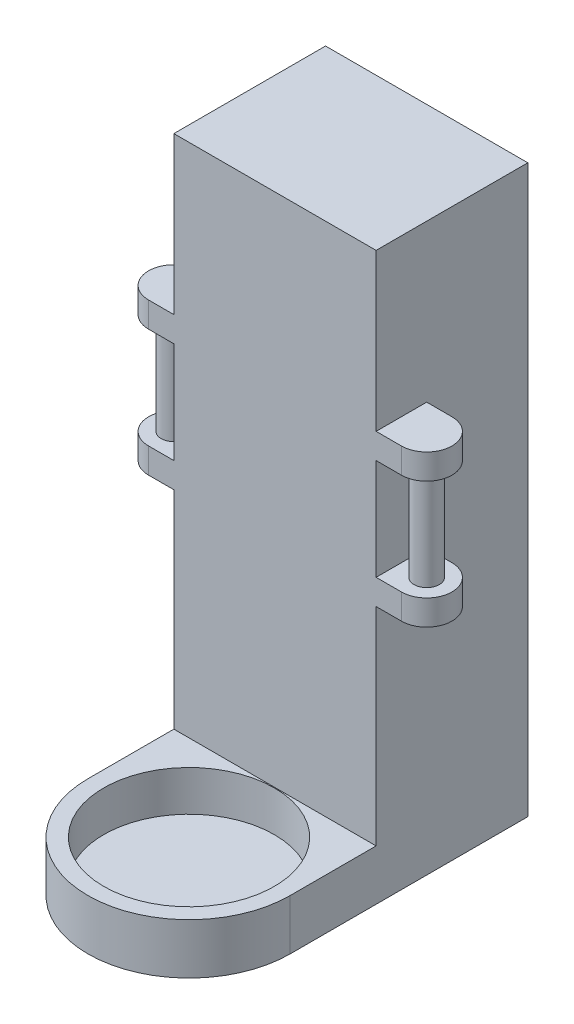
ISO-10303-21;
HEADER;
FILE_DESCRIPTION(('STEP AP214'),'2;1');
FILE_NAME('part.step','',(''),(''),'','','');
FILE_SCHEMA(('AUTOMOTIVE_DESIGN { 1 0 10303 214 1 1 1 1 }'));
ENDSEC;
DATA;
#1=APPLICATION_CONTEXT('core data for automotive mechanical design processes');
#2=APPLICATION_PROTOCOL_DEFINITION('international standard','automotive_design',2000,#1);
#3=PRODUCT_CONTEXT('',#1,'mechanical');
#4=PRODUCT('Part','Part','',(#3));
#5=PRODUCT_RELATED_PRODUCT_CATEGORY('part','',(#4));
#6=PRODUCT_DEFINITION_FORMATION('','',#4);
#7=PRODUCT_DEFINITION_CONTEXT('part definition',#1,'design');
#8=PRODUCT_DEFINITION('design','',#6,#7);
#9=PRODUCT_DEFINITION_SHAPE('','',#8);
#10=(LENGTH_UNIT() NAMED_UNIT(*) SI_UNIT(.MILLI.,.METRE.));
#11=(NAMED_UNIT(*) PLANE_ANGLE_UNIT() SI_UNIT($,.RADIAN.));
#12=(NAMED_UNIT(*) SI_UNIT($,.STERADIAN.) SOLID_ANGLE_UNIT());
#13=UNCERTAINTY_MEASURE_WITH_UNIT(LENGTH_MEASURE(1.E-05),#10,'distance_accuracy_value','');
#14=(GEOMETRIC_REPRESENTATION_CONTEXT(3) GLOBAL_UNCERTAINTY_ASSIGNED_CONTEXT((#13)) GLOBAL_UNIT_ASSIGNED_CONTEXT((#10,
#11,#12)) REPRESENTATION_CONTEXT('',''));
#15=CARTESIAN_POINT('',(0.,0.,0.));
#16=DIRECTION('',(0.,0.,1.));
#17=DIRECTION('',(1.,0.,0.));
#18=AXIS2_PLACEMENT_3D('',#15,#16,#17);
#19=CARTESIAN_POINT('',(-25.4,-71.12,38.1));
#20=DIRECTION('',(1.,0.,0.));
#21=DIRECTION('',(0.,0.,-1.));
#22=AXIS2_PLACEMENT_3D('',#19,#20,#21);
#23=PLANE('',#22);
#24=DIRECTION('',(0.,0.,-1.));
#25=VECTOR('',#24,1.);
#26=CARTESIAN_POINT('',(-25.4,31.75,25.4));
#27=LINE('',#26,#25);
#28=CARTESIAN_POINT('',(-25.4,31.75,38.1));
#29=VERTEX_POINT('',#28);
#30=CARTESIAN_POINT('',(-25.4,31.75,25.4));
#31=VERTEX_POINT('',#30);
#32=EDGE_CURVE('E281',#29,#31,#27,.T.);
#33=ORIENTED_EDGE('',*,*,#32,.F.);
#34=DIRECTION('',(0.,-1.,0.));
#35=VECTOR('',#34,1.);
#36=CARTESIAN_POINT('',(-25.4,-71.12,38.1));
#37=LINE('',#36,#35);
#38=CARTESIAN_POINT('',(-25.4,71.12,38.1));
#39=VERTEX_POINT('',#38);
#40=EDGE_CURVE('E349',#39,#29,#37,.T.);
#41=ORIENTED_EDGE('',*,*,#40,.F.);
#42=DIRECTION('',(0.,0.,-1.));
#43=VECTOR('',#42,1.);
#44=CARTESIAN_POINT('',(-25.4,71.12,38.1));
#45=LINE('',#44,#43);
#46=CARTESIAN_POINT('',(-25.4,71.12,0.));
#47=VERTEX_POINT('',#46);
#48=EDGE_CURVE('E367',#39,#47,#45,.T.);
#49=ORIENTED_EDGE('',*,*,#48,.T.);
#50=DIRECTION('',(0.,-1.,0.));
#51=VECTOR('',#50,1.);
#52=CARTESIAN_POINT('',(-25.4,-71.12,0.));
#53=LINE('',#52,#51);
#54=CARTESIAN_POINT('',(-25.4,-71.12,0.));
#55=VERTEX_POINT('',#54);
#56=EDGE_CURVE('E358',#47,#55,#53,.T.);
#57=ORIENTED_EDGE('',*,*,#56,.T.);
#58=DIRECTION('',(0.,0.,-1.));
#59=VECTOR('',#58,1.);
#60=CARTESIAN_POINT('',(-25.4,-71.12,38.1));
#61=LINE('',#60,#59);
#62=CARTESIAN_POINT('',(-25.4,-71.12,59.69));
#63=VERTEX_POINT('',#62);
#64=EDGE_CURVE('E365',#63,#55,#61,.T.);
#65=ORIENTED_EDGE('',*,*,#64,.F.);
#66=DIRECTION('',(0.,-1.,0.));
#67=VECTOR('',#66,1.);
#68=CARTESIAN_POINT('',(-25.4,-58.42,59.69));
#69=LINE('',#68,#67);
#70=CARTESIAN_POINT('',(-25.4,-58.42,59.69));
#71=VERTEX_POINT('',#70);
#72=EDGE_CURVE('E337',#71,#63,#69,.T.);
#73=ORIENTED_EDGE('',*,*,#72,.F.);
#74=DIRECTION('',(0.,0.,1.));
#75=VECTOR('',#74,1.);
#76=CARTESIAN_POINT('',(-25.4,-58.42,0.));
#77=LINE('',#76,#75);
#78=CARTESIAN_POINT('',(-25.4,-58.42,38.1));
#79=VERTEX_POINT('',#78);
#80=EDGE_CURVE('E329',#79,#71,#77,.T.);
#81=ORIENTED_EDGE('',*,*,#80,.F.);
#82=CARTESIAN_POINT('',(-25.4,-6.34999999999999,38.1));
#83=VERTEX_POINT('',#82);
#84=EDGE_CURVE('E348',#83,#79,#37,.T.);
#85=ORIENTED_EDGE('',*,*,#84,.F.);
#86=DIRECTION('',(0.,0.,1.));
#87=VECTOR('',#86,1.);
#88=CARTESIAN_POINT('',(-25.4,-6.34999999999999,38.1));
#89=LINE('',#88,#87);
#90=CARTESIAN_POINT('',(-25.4,-6.35,25.4));
#91=VERTEX_POINT('',#90);
#92=EDGE_CURVE('E283',#91,#83,#89,.T.);
#93=ORIENTED_EDGE('',*,*,#92,.F.);
#94=DIRECTION('',(0.,-1.,0.));
#95=VECTOR('',#94,1.);
#96=CARTESIAN_POINT('',(-25.4,-6.35,25.4));
#97=LINE('',#96,#95);
#98=CARTESIAN_POINT('',(-25.4,0.,25.4));
#99=VERTEX_POINT('',#98);
#100=EDGE_CURVE('E292',#99,#91,#97,.T.);
#101=ORIENTED_EDGE('',*,*,#100,.F.);
#102=DIRECTION('',(0.,0.,-1.));
#103=VECTOR('',#102,1.);
#104=CARTESIAN_POINT('',(-25.4,0.,25.4));
#105=LINE('',#104,#103);
#106=CARTESIAN_POINT('',(-25.4,0.,38.1));
#107=VERTEX_POINT('',#106);
#108=EDGE_CURVE('E298',#107,#99,#105,.T.);
#109=ORIENTED_EDGE('',*,*,#108,.F.);
#110=CARTESIAN_POINT('',(-25.4,25.4,38.1));
#111=VERTEX_POINT('',#110);
#112=EDGE_CURVE('E353',#111,#107,#37,.T.);
#113=ORIENTED_EDGE('',*,*,#112,.F.);
#114=DIRECTION('',(0.,0.,1.));
#115=VECTOR('',#114,1.);
#116=CARTESIAN_POINT('',(-25.4,25.4,38.1));
#117=LINE('',#116,#115);
#118=CARTESIAN_POINT('',(-25.4,25.4,25.4));
#119=VERTEX_POINT('',#118);
#120=EDGE_CURVE('E275',#119,#111,#117,.T.);
#121=ORIENTED_EDGE('',*,*,#120,.F.);
#122=DIRECTION('',(0.,-1.,0.));
#123=VECTOR('',#122,1.);
#124=CARTESIAN_POINT('',(-25.4,25.4,25.4));
#125=LINE('',#124,#123);
#126=EDGE_CURVE('E278',#31,#119,#125,.T.);
#127=ORIENTED_EDGE('',*,*,#126,.F.);
#128=EDGE_LOOP('',(#33,#41,#49,#57,#65,#73,#81,#85,#93,#101,#109,#113,#121,#127));
#129=FACE_BOUND('',#128,.T.);
#130=ADVANCED_FACE('F45',(#129),#23,.F.);
#131=CARTESIAN_POINT('',(0.,-58.42,59.69));
#132=DIRECTION('',(0.,-1.,0.));
#133=DIRECTION('',(0.,0.,-1.));
#134=AXIS2_PLACEMENT_3D('',#131,#132,#133);
#135=CYLINDRICAL_SURFACE('',#134,21.43125);
#136=CARTESIAN_POINT('',(0.,-58.42,59.69));
#137=DIRECTION('',(0.,-1.,0.));
#138=DIRECTION('',(0.,0.,-1.));
#139=AXIS2_PLACEMENT_3D('',#136,#137,#138);
#140=CIRCLE('',#139,21.43125);
#141=CARTESIAN_POINT('',(0.,-58.42,38.25875));
#142=VERTEX_POINT('',#141);
#143=EDGE_CURVE('E320',#142,#142,#140,.T.);
#144=ORIENTED_EDGE('',*,*,#143,.F.);
#145=EDGE_LOOP('',(#144));
#146=FACE_BOUND('',#145,.T.);
#147=CARTESIAN_POINT('',(0.,-68.58,59.69));
#148=DIRECTION('',(0.,-1.,0.));
#149=DIRECTION('',(0.,0.,-1.));
#150=AXIS2_PLACEMENT_3D('',#147,#148,#149);
#151=CIRCLE('',#150,21.43125);
#152=CARTESIAN_POINT('',(0.,-68.58,38.25875));
#153=VERTEX_POINT('',#152);
#154=EDGE_CURVE('E315',#153,#153,#151,.F.);
#155=ORIENTED_EDGE('',*,*,#154,.F.);
#156=EDGE_LOOP('',(#155));
#157=FACE_BOUND('',#156,.T.);
#158=ADVANCED_FACE('F395',(#146,#157),#135,.F.);
#159=CARTESIAN_POINT('',(0.,0.,38.1));
#160=DIRECTION('',(0.,0.,-1.));
#161=DIRECTION('',(-1.,0.,0.));
#162=AXIS2_PLACEMENT_3D('',#159,#160,#161);
#163=PLANE('',#162);
#164=DIRECTION('',(-1.,0.,0.));
#165=VECTOR('',#164,1.);
#166=CARTESIAN_POINT('',(0.,-58.42,38.1));
#167=LINE('',#166,#165);
#168=CARTESIAN_POINT('',(25.4,-58.42,38.1));
#169=VERTEX_POINT('',#168);
#170=EDGE_CURVE('E331',#169,#79,#167,.T.);
#171=ORIENTED_EDGE('',*,*,#170,.F.);
#172=DIRECTION('',(0.,1.,0.));
#173=VECTOR('',#172,1.);
#174=CARTESIAN_POINT('',(25.4,-71.12,38.1));
#175=LINE('',#174,#173);
#176=CARTESIAN_POINT('',(25.4,-6.34999999999999,38.1));
#177=VERTEX_POINT('',#176);
#178=EDGE_CURVE('E341',#169,#177,#175,.T.);
#179=ORIENTED_EDGE('',*,*,#178,.T.);
#180=DIRECTION('',(-1.,0.,0.));
#181=VECTOR('',#180,1.);
#182=CARTESIAN_POINT('',(31.75,-6.34999999999999,38.1));
#183=LINE('',#182,#181);
#184=CARTESIAN_POINT('',(31.75,-6.34999999999999,38.1));
#185=VERTEX_POINT('',#184);
#186=EDGE_CURVE('E238',#185,#177,#183,.T.);
#187=ORIENTED_EDGE('',*,*,#186,.F.);
#188=DIRECTION('',(0.,1.,0.));
#189=VECTOR('',#188,1.);
#190=CARTESIAN_POINT('',(31.75,0.,38.1));
#191=LINE('',#190,#189);
#192=CARTESIAN_POINT('',(31.75,0.,38.1));
#193=VERTEX_POINT('',#192);
#194=EDGE_CURVE('E235',#185,#193,#191,.T.);
#195=ORIENTED_EDGE('',*,*,#194,.T.);
#196=DIRECTION('',(-1.,0.,0.));
#197=VECTOR('',#196,1.);
#198=CARTESIAN_POINT('',(31.75,0.,38.1));
#199=LINE('',#198,#197);
#200=CARTESIAN_POINT('',(25.4,0.,38.1));
#201=VERTEX_POINT('',#200);
#202=EDGE_CURVE('E246',#193,#201,#199,.T.);
#203=ORIENTED_EDGE('',*,*,#202,.T.);
#204=CARTESIAN_POINT('',(25.4,25.4,38.1));
#205=VERTEX_POINT('',#204);
#206=EDGE_CURVE('E345',#201,#205,#175,.T.);
#207=ORIENTED_EDGE('',*,*,#206,.T.);
#208=DIRECTION('',(-1.,0.,0.));
#209=VECTOR('',#208,1.);
#210=CARTESIAN_POINT('',(31.75,25.4,38.1));
#211=LINE('',#210,#209);
#212=CARTESIAN_POINT('',(31.75,25.4,38.1));
#213=VERTEX_POINT('',#212);
#214=EDGE_CURVE('E213',#213,#205,#211,.T.);
#215=ORIENTED_EDGE('',*,*,#214,.F.);
#216=DIRECTION('',(0.,1.,0.));
#217=VECTOR('',#216,1.);
#218=CARTESIAN_POINT('',(31.75,31.75,38.1));
#219=LINE('',#218,#217);
#220=CARTESIAN_POINT('',(31.75,31.75,38.1));
#221=VERTEX_POINT('',#220);
#222=EDGE_CURVE('E202',#213,#221,#219,.T.);
#223=ORIENTED_EDGE('',*,*,#222,.T.);
#224=DIRECTION('',(-1.,0.,0.));
#225=VECTOR('',#224,1.);
#226=CARTESIAN_POINT('',(31.75,31.75,38.1));
#227=LINE('',#226,#225);
#228=CARTESIAN_POINT('',(25.4,31.75,38.1));
#229=VERTEX_POINT('',#228);
#230=EDGE_CURVE('E217',#221,#229,#227,.T.);
#231=ORIENTED_EDGE('',*,*,#230,.T.);
#232=CARTESIAN_POINT('',(25.4,71.12,38.1));
#233=VERTEX_POINT('',#232);
#234=EDGE_CURVE('E346',#229,#233,#175,.T.);
#235=ORIENTED_EDGE('',*,*,#234,.T.);
#236=DIRECTION('',(-1.,0.,0.));
#237=VECTOR('',#236,1.);
#238=CARTESIAN_POINT('',(-25.4,71.12,38.1));
#239=LINE('',#238,#237);
#240=EDGE_CURVE('E344',#233,#39,#239,.T.);
#241=ORIENTED_EDGE('',*,*,#240,.T.);
#242=ORIENTED_EDGE('',*,*,#40,.T.);
#243=DIRECTION('',(1.,0.,0.));
#244=VECTOR('',#243,1.);
#245=CARTESIAN_POINT('',(-31.75,31.75,38.1));
#246=LINE('',#245,#244);
#247=CARTESIAN_POINT('',(-31.75,31.75,38.1));
#248=VERTEX_POINT('',#247);
#249=EDGE_CURVE('E262',#248,#29,#246,.T.);
#250=ORIENTED_EDGE('',*,*,#249,.F.);
#251=DIRECTION('',(0.,1.,0.));
#252=VECTOR('',#251,1.);
#253=CARTESIAN_POINT('',(-31.75,31.75,38.1));
#254=LINE('',#253,#252);
#255=CARTESIAN_POINT('',(-31.75,25.4,38.1));
#256=VERTEX_POINT('',#255);
#257=EDGE_CURVE('E279',#256,#248,#254,.T.);
#258=ORIENTED_EDGE('',*,*,#257,.F.);
#259=DIRECTION('',(1.,0.,0.));
#260=VECTOR('',#259,1.);
#261=CARTESIAN_POINT('',(-31.75,25.4,38.1));
#262=LINE('',#261,#260);
#263=EDGE_CURVE('E272',#256,#111,#262,.T.);
#264=ORIENTED_EDGE('',*,*,#263,.T.);
#265=ORIENTED_EDGE('',*,*,#112,.T.);
#266=DIRECTION('',(1.,0.,0.));
#267=VECTOR('',#266,1.);
#268=CARTESIAN_POINT('',(-31.75,0.,38.1));
#269=LINE('',#268,#267);
#270=CARTESIAN_POINT('',(-31.75,0.,38.1));
#271=VERTEX_POINT('',#270);
#272=EDGE_CURVE('E308',#271,#107,#269,.T.);
#273=ORIENTED_EDGE('',*,*,#272,.F.);
#274=DIRECTION('',(0.,1.,0.));
#275=VECTOR('',#274,1.);
#276=CARTESIAN_POINT('',(-31.75,0.,38.1));
#277=LINE('',#276,#275);
#278=CARTESIAN_POINT('',(-31.75,-6.35,38.1));
#279=VERTEX_POINT('',#278);
#280=EDGE_CURVE('E288',#279,#271,#277,.T.);
#281=ORIENTED_EDGE('',*,*,#280,.F.);
#282=DIRECTION('',(1.,0.,0.));
#283=VECTOR('',#282,1.);
#284=CARTESIAN_POINT('',(-31.75,-6.34999999999999,38.1));
#285=LINE('',#284,#283);
#286=EDGE_CURVE('E311',#279,#83,#285,.T.);
#287=ORIENTED_EDGE('',*,*,#286,.T.);
#288=ORIENTED_EDGE('',*,*,#84,.T.);
#289=EDGE_LOOP('',(#171,#179,#187,#195,#203,#207,#215,#223,#231,#235,#241,#242,#250,#258,#264,
#265,#273,#281,#287,#288));
#290=FACE_BOUND('',#289,.T.);
#291=ADVANCED_FACE('F401',(#290),#163,.F.);
#292=CARTESIAN_POINT('',(25.4,-71.12,38.1));
#293=DIRECTION('',(-1.,0.,0.));
#294=DIRECTION('',(0.,0.,1.));
#295=AXIS2_PLACEMENT_3D('',#292,#293,#294);
#296=PLANE('',#295);
#297=DIRECTION('',(0.,-1.,0.));
#298=VECTOR('',#297,1.);
#299=CARTESIAN_POINT('',(25.4,25.4,25.4));
#300=LINE('',#299,#298);
#301=CARTESIAN_POINT('',(25.4,31.75,25.4));
#302=VERTEX_POINT('',#301);
#303=CARTESIAN_POINT('',(25.4,25.4,25.4));
#304=VERTEX_POINT('',#303);
#305=EDGE_CURVE('E60',#302,#304,#300,.T.);
#306=ORIENTED_EDGE('',*,*,#305,.T.);
#307=DIRECTION('',(0.,0.,1.));
#308=VECTOR('',#307,1.);
#309=CARTESIAN_POINT('',(25.4,25.4,38.1));
#310=LINE('',#309,#308);
#311=EDGE_CURVE('E212',#304,#205,#310,.T.);
#312=ORIENTED_EDGE('',*,*,#311,.T.);
#313=ORIENTED_EDGE('',*,*,#206,.F.);
#314=DIRECTION('',(0.,0.,-1.));
#315=VECTOR('',#314,1.);
#316=CARTESIAN_POINT('',(25.4,0.,25.4));
#317=LINE('',#316,#315);
#318=CARTESIAN_POINT('',(25.4,0.,25.4));
#319=VERTEX_POINT('',#318);
#320=EDGE_CURVE('E68',#201,#319,#317,.T.);
#321=ORIENTED_EDGE('',*,*,#320,.T.);
#322=DIRECTION('',(0.,-1.,0.));
#323=VECTOR('',#322,1.);
#324=CARTESIAN_POINT('',(25.4,-6.35,25.4));
#325=LINE('',#324,#323);
#326=CARTESIAN_POINT('',(25.4,-6.35,25.4));
#327=VERTEX_POINT('',#326);
#328=EDGE_CURVE('E241',#319,#327,#325,.T.);
#329=ORIENTED_EDGE('',*,*,#328,.T.);
#330=DIRECTION('',(0.,0.,1.));
#331=VECTOR('',#330,1.);
#332=CARTESIAN_POINT('',(25.4,-6.34999999999999,38.1));
#333=LINE('',#332,#331);
#334=EDGE_CURVE('E231',#327,#177,#333,.T.);
#335=ORIENTED_EDGE('',*,*,#334,.T.);
#336=ORIENTED_EDGE('',*,*,#178,.F.);
#337=DIRECTION('',(0.,0.,1.));
#338=VECTOR('',#337,1.);
#339=CARTESIAN_POINT('',(25.4,-58.42,0.));
#340=LINE('',#339,#338);
#341=CARTESIAN_POINT('',(25.4,-58.42,59.69));
#342=VERTEX_POINT('',#341);
#343=EDGE_CURVE('E323',#169,#342,#340,.T.);
#344=ORIENTED_EDGE('',*,*,#343,.T.);
#345=DIRECTION('',(0.,-1.,0.));
#346=VECTOR('',#345,1.);
#347=CARTESIAN_POINT('',(25.4,-58.42,59.69));
#348=LINE('',#347,#346);
#349=CARTESIAN_POINT('',(25.4,-71.12,59.69));
#350=VERTEX_POINT('',#349);
#351=EDGE_CURVE('E334',#342,#350,#348,.T.);
#352=ORIENTED_EDGE('',*,*,#351,.T.);
#353=DIRECTION('',(0.,0.,-1.));
#354=VECTOR('',#353,1.);
#355=CARTESIAN_POINT('',(25.4,-71.12,38.1));
#356=LINE('',#355,#354);
#357=CARTESIAN_POINT('',(25.4,-71.12,0.));
#358=VERTEX_POINT('',#357);
#359=EDGE_CURVE('E352',#350,#358,#356,.T.);
#360=ORIENTED_EDGE('',*,*,#359,.T.);
#361=DIRECTION('',(0.,1.,0.));
#362=VECTOR('',#361,1.);
#363=CARTESIAN_POINT('',(25.4,-71.12,0.));
#364=LINE('',#363,#362);
#365=CARTESIAN_POINT('',(25.4,71.12,0.));
#366=VERTEX_POINT('',#365);
#367=EDGE_CURVE('E339',#358,#366,#364,.T.);
#368=ORIENTED_EDGE('',*,*,#367,.T.);
#369=DIRECTION('',(0.,0.,-1.));
#370=VECTOR('',#369,1.);
#371=CARTESIAN_POINT('',(25.4,71.12,38.1));
#372=LINE('',#371,#370);
#373=EDGE_CURVE('E319',#233,#366,#372,.T.);
#374=ORIENTED_EDGE('',*,*,#373,.F.);
#375=ORIENTED_EDGE('',*,*,#234,.F.);
#376=DIRECTION('',(0.,0.,-1.));
#377=VECTOR('',#376,1.);
#378=CARTESIAN_POINT('',(25.4,31.75,25.4));
#379=LINE('',#378,#377);
#380=EDGE_CURVE('E220',#229,#302,#379,.T.);
#381=ORIENTED_EDGE('',*,*,#380,.T.);
#382=EDGE_LOOP('',(#306,#312,#313,#321,#329,#335,#336,#344,#352,#360,#368,#374,#375,#381));
#383=FACE_BOUND('',#382,.T.);
#384=ADVANCED_FACE('F47',(#383),#296,.F.);
#385=CARTESIAN_POINT('',(-25.4,71.12,38.1));
#386=DIRECTION('',(0.,-1.,0.));
#387=DIRECTION('',(0.,0.,-1.));
#388=AXIS2_PLACEMENT_3D('',#385,#386,#387);
#389=PLANE('',#388);
#390=DIRECTION('',(-1.,0.,0.));
#391=VECTOR('',#390,1.);
#392=CARTESIAN_POINT('',(-25.4,71.12,0.));
#393=LINE('',#392,#391);
#394=EDGE_CURVE('E356',#366,#47,#393,.T.);
#395=ORIENTED_EDGE('',*,*,#394,.T.);
#396=ORIENTED_EDGE('',*,*,#48,.F.);
#397=ORIENTED_EDGE('',*,*,#240,.F.);
#398=ORIENTED_EDGE('',*,*,#373,.T.);
#399=EDGE_LOOP('',(#395,#396,#397,#398));
#400=FACE_BOUND('',#399,.T.);
#401=ADVANCED_FACE('F408',(#400),#389,.F.);
#402=CARTESIAN_POINT('',(-25.4,-71.12,38.1));
#403=DIRECTION('',(0.,1.,0.));
#404=DIRECTION('',(0.,0.,1.));
#405=AXIS2_PLACEMENT_3D('',#402,#403,#404);
#406=PLANE('',#405);
#407=ORIENTED_EDGE('',*,*,#64,.T.);
#408=DIRECTION('',(1.,0.,0.));
#409=VECTOR('',#408,1.);
#410=CARTESIAN_POINT('',(-25.4,-71.12,0.));
#411=LINE('',#410,#409);
#412=EDGE_CURVE('E361',#55,#358,#411,.T.);
#413=ORIENTED_EDGE('',*,*,#412,.T.);
#414=ORIENTED_EDGE('',*,*,#359,.F.);
#415=CARTESIAN_POINT('',(0.,-71.12,59.69));
#416=DIRECTION('',(0.,-1.,0.));
#417=DIRECTION('',(0.,0.,-1.));
#418=AXIS2_PLACEMENT_3D('',#415,#416,#417);
#419=CIRCLE('',#418,25.4);
#420=EDGE_CURVE('E314',#350,#63,#419,.T.);
#421=ORIENTED_EDGE('',*,*,#420,.T.);
#422=EDGE_LOOP('',(#407,#413,#414,#421));
#423=FACE_BOUND('',#422,.T.);
#424=ADVANCED_FACE('F406',(#423),#406,.F.);
#425=CARTESIAN_POINT('',(0.,0.,0.));
#426=DIRECTION('',(0.,0.,-1.));
#427=DIRECTION('',(-1.,0.,0.));
#428=AXIS2_PLACEMENT_3D('',#425,#426,#427);
#429=PLANE('',#428);
#430=ORIENTED_EDGE('',*,*,#367,.F.);
#431=ORIENTED_EDGE('',*,*,#412,.F.);
#432=ORIENTED_EDGE('',*,*,#56,.F.);
#433=ORIENTED_EDGE('',*,*,#394,.F.);
#434=EDGE_LOOP('',(#430,#431,#432,#433));
#435=FACE_BOUND('',#434,.T.);
#436=ADVANCED_FACE('F415',(#435),#429,.T.);
#437=CARTESIAN_POINT('',(0.,-58.42,59.69));
#438=DIRECTION('',(0.,-1.,0.));
#439=DIRECTION('',(0.,0.,-1.));
#440=AXIS2_PLACEMENT_3D('',#437,#438,#439);
#441=CYLINDRICAL_SURFACE('',#440,25.4);
#442=ORIENTED_EDGE('',*,*,#420,.F.);
#443=ORIENTED_EDGE('',*,*,#351,.F.);
#444=CARTESIAN_POINT('',(0.,-58.42,59.69));
#445=DIRECTION('',(0.,-1.,0.));
#446=DIRECTION('',(0.,0.,-1.));
#447=AXIS2_PLACEMENT_3D('',#444,#445,#446);
#448=CIRCLE('',#447,25.4);
#449=EDGE_CURVE('E326',#342,#71,#448,.T.);
#450=ORIENTED_EDGE('',*,*,#449,.T.);
#451=ORIENTED_EDGE('',*,*,#72,.T.);
#452=EDGE_LOOP('',(#442,#443,#450,#451));
#453=FACE_BOUND('',#452,.T.);
#454=ADVANCED_FACE('F433',(#453),#441,.T.);
#455=CARTESIAN_POINT('',(0.,-58.42,0.));
#456=DIRECTION('',(0.,-1.,0.));
#457=DIRECTION('',(0.,0.,-1.));
#458=AXIS2_PLACEMENT_3D('',#455,#456,#457);
#459=PLANE('',#458);
#460=ORIENTED_EDGE('',*,*,#143,.T.);
#461=EDGE_LOOP('',(#460));
#462=FACE_BOUND('',#461,.T.);
#463=ORIENTED_EDGE('',*,*,#343,.F.);
#464=ORIENTED_EDGE('',*,*,#170,.T.);
#465=ORIENTED_EDGE('',*,*,#80,.T.);
#466=ORIENTED_EDGE('',*,*,#449,.F.);
#467=EDGE_LOOP('',(#463,#464,#465,#466));
#468=FACE_BOUND('',#467,.T.);
#469=ADVANCED_FACE('F436',(#462,#468),#459,.F.);
#470=CARTESIAN_POINT('',(0.,-68.58,0.));
#471=DIRECTION('',(0.,-1.,0.));
#472=DIRECTION('',(0.,0.,-1.));
#473=AXIS2_PLACEMENT_3D('',#470,#471,#472);
#474=PLANE('',#473);
#475=ORIENTED_EDGE('',*,*,#154,.T.);
#476=EDGE_LOOP('',(#475));
#477=FACE_BOUND('',#476,.T.);
#478=ADVANCED_FACE('F475',(#477),#474,.F.);
#479=CARTESIAN_POINT('',(-31.75,-6.34999999999999,38.1));
#480=DIRECTION('',(0.,1.,0.));
#481=DIRECTION('',(0.,0.,1.));
#482=AXIS2_PLACEMENT_3D('',#479,#480,#481);
#483=PLANE('',#482);
#484=ORIENTED_EDGE('',*,*,#92,.T.);
#485=ORIENTED_EDGE('',*,*,#286,.F.);
#486=CARTESIAN_POINT('',(-31.75,-6.35,31.75));
#487=DIRECTION('',(0.,-1.,0.));
#488=DIRECTION('',(0.,0.,-1.));
#489=AXIS2_PLACEMENT_3D('',#486,#487,#488);
#490=CIRCLE('',#489,6.35);
#491=CARTESIAN_POINT('',(-31.75,-6.35,25.4));
#492=VERTEX_POINT('',#491);
#493=EDGE_CURVE('E256',#279,#492,#490,.T.);
#494=ORIENTED_EDGE('',*,*,#493,.T.);
#495=DIRECTION('',(1.,0.,0.));
#496=VECTOR('',#495,1.);
#497=CARTESIAN_POINT('',(-31.75,-6.35,25.4));
#498=LINE('',#497,#496);
#499=EDGE_CURVE('E295',#492,#91,#498,.T.);
#500=ORIENTED_EDGE('',*,*,#499,.T.);
#501=EDGE_LOOP('',(#484,#485,#494,#500));
#502=FACE_BOUND('',#501,.T.);
#503=ADVANCED_FACE('F454',(#502),#483,.F.);
#504=CARTESIAN_POINT('',(-31.75,0.,25.4));
#505=DIRECTION('',(0.,-1.,0.));
#506=DIRECTION('',(0.,0.,-1.));
#507=AXIS2_PLACEMENT_3D('',#504,#505,#506);
#508=PLANE('',#507);
#509=CARTESIAN_POINT('',(-31.75,0.,31.75));
#510=DIRECTION('',(0.,-1.,0.));
#511=DIRECTION('',(0.,0.,-1.));
#512=AXIS2_PLACEMENT_3D('',#509,#510,#511);
#513=CIRCLE('',#512,3.175);
#514=CARTESIAN_POINT('',(-31.75,0.,28.575));
#515=VERTEX_POINT('',#514);
#516=EDGE_CURVE('E374',#515,#515,#513,.F.);
#517=ORIENTED_EDGE('',*,*,#516,.F.);
#518=EDGE_LOOP('',(#517));
#519=FACE_BOUND('',#518,.T.);
#520=ORIENTED_EDGE('',*,*,#108,.T.);
#521=DIRECTION('',(1.,0.,0.));
#522=VECTOR('',#521,1.);
#523=CARTESIAN_POINT('',(-31.75,0.,25.4));
#524=LINE('',#523,#522);
#525=CARTESIAN_POINT('',(-31.75,0.,25.4));
#526=VERTEX_POINT('',#525);
#527=EDGE_CURVE('E305',#526,#99,#524,.T.);
#528=ORIENTED_EDGE('',*,*,#527,.F.);
#529=CARTESIAN_POINT('',(-31.75,0.,31.75));
#530=DIRECTION('',(0.,-1.,0.));
#531=DIRECTION('',(0.,0.,-1.));
#532=AXIS2_PLACEMENT_3D('',#529,#530,#531);
#533=CIRCLE('',#532,6.35);
#534=EDGE_CURVE('E259',#271,#526,#533,.T.);
#535=ORIENTED_EDGE('',*,*,#534,.F.);
#536=ORIENTED_EDGE('',*,*,#272,.T.);
#537=EDGE_LOOP('',(#520,#528,#535,#536));
#538=FACE_BOUND('',#537,.T.);
#539=ADVANCED_FACE('F448',(#519,#538),#508,.F.);
#540=CARTESIAN_POINT('',(-31.75,-6.35,25.4));
#541=DIRECTION('',(0.,0.,1.));
#542=DIRECTION('',(1.,0.,0.));
#543=AXIS2_PLACEMENT_3D('',#540,#541,#542);
#544=PLANE('',#543);
#545=ORIENTED_EDGE('',*,*,#100,.T.);
#546=ORIENTED_EDGE('',*,*,#499,.F.);
#547=DIRECTION('',(0.,-1.,0.));
#548=VECTOR('',#547,1.);
#549=CARTESIAN_POINT('',(-31.75,-6.35,25.4));
#550=LINE('',#549,#548);
#551=EDGE_CURVE('E291',#526,#492,#550,.T.);
#552=ORIENTED_EDGE('',*,*,#551,.F.);
#553=ORIENTED_EDGE('',*,*,#527,.T.);
#554=EDGE_LOOP('',(#545,#546,#552,#553));
#555=FACE_BOUND('',#554,.T.);
#556=ADVANCED_FACE('F456',(#555),#544,.F.);
#557=CARTESIAN_POINT('',(-31.75,31.75,25.4));
#558=DIRECTION('',(0.,-1.,0.));
#559=DIRECTION('',(0.,0.,-1.));
#560=AXIS2_PLACEMENT_3D('',#557,#558,#559);
#561=PLANE('',#560);
#562=ORIENTED_EDGE('',*,*,#32,.T.);
#563=DIRECTION('',(1.,0.,0.));
#564=VECTOR('',#563,1.);
#565=CARTESIAN_POINT('',(-31.75,31.75,25.4));
#566=LINE('',#565,#564);
#567=CARTESIAN_POINT('',(-31.75,31.75,25.4));
#568=VERTEX_POINT('',#567);
#569=EDGE_CURVE('E266',#568,#31,#566,.T.);
#570=ORIENTED_EDGE('',*,*,#569,.F.);
#571=CARTESIAN_POINT('',(-31.75,31.75,31.75));
#572=DIRECTION('',(0.,-1.,0.));
#573=DIRECTION('',(0.,0.,-1.));
#574=AXIS2_PLACEMENT_3D('',#571,#572,#573);
#575=CIRCLE('',#574,6.35);
#576=EDGE_CURVE('E252',#248,#568,#575,.T.);
#577=ORIENTED_EDGE('',*,*,#576,.F.);
#578=ORIENTED_EDGE('',*,*,#249,.T.);
#579=EDGE_LOOP('',(#562,#570,#577,#578));
#580=FACE_BOUND('',#579,.T.);
#581=ADVANCED_FACE('F458',(#580),#561,.F.);
#582=CARTESIAN_POINT('',(-31.75,25.4,25.4));
#583=DIRECTION('',(0.,0.,1.));
#584=DIRECTION('',(0.,-1.,0.));
#585=AXIS2_PLACEMENT_3D('',#582,#583,#584);
#586=PLANE('',#585);
#587=ORIENTED_EDGE('',*,*,#126,.T.);
#588=DIRECTION('',(1.,0.,0.));
#589=VECTOR('',#588,1.);
#590=CARTESIAN_POINT('',(-31.75,25.4,25.4));
#591=LINE('',#590,#589);
#592=CARTESIAN_POINT('',(-31.75,25.4,25.4));
#593=VERTEX_POINT('',#592);
#594=EDGE_CURVE('E269',#593,#119,#591,.T.);
#595=ORIENTED_EDGE('',*,*,#594,.F.);
#596=DIRECTION('',(0.,-1.,0.));
#597=VECTOR('',#596,1.);
#598=CARTESIAN_POINT('',(-31.75,25.4,25.4));
#599=LINE('',#598,#597);
#600=EDGE_CURVE('E274',#568,#593,#599,.T.);
#601=ORIENTED_EDGE('',*,*,#600,.F.);
#602=ORIENTED_EDGE('',*,*,#569,.T.);
#603=EDGE_LOOP('',(#587,#595,#601,#602));
#604=FACE_BOUND('',#603,.T.);
#605=ADVANCED_FACE('F464',(#604),#586,.F.);
#606=CARTESIAN_POINT('',(-31.75,25.4,38.1));
#607=DIRECTION('',(0.,1.,0.));
#608=DIRECTION('',(0.,0.,1.));
#609=AXIS2_PLACEMENT_3D('',#606,#607,#608);
#610=PLANE('',#609);
#611=CARTESIAN_POINT('',(-31.75,25.4,31.75));
#612=DIRECTION('',(0.,1.,0.));
#613=DIRECTION('',(0.,0.,1.));
#614=AXIS2_PLACEMENT_3D('',#611,#612,#613);
#615=CIRCLE('',#614,3.175);
#616=CARTESIAN_POINT('',(-31.75,25.4,34.925));
#617=VERTEX_POINT('',#616);
#618=EDGE_CURVE('E318',#617,#617,#615,.F.);
#619=ORIENTED_EDGE('',*,*,#618,.F.);
#620=EDGE_LOOP('',(#619));
#621=FACE_BOUND('',#620,.T.);
#622=ORIENTED_EDGE('',*,*,#120,.T.);
#623=ORIENTED_EDGE('',*,*,#263,.F.);
#624=CARTESIAN_POINT('',(-31.75,25.4,31.75));
#625=DIRECTION('',(0.,-1.,0.));
#626=DIRECTION('',(0.,0.,-1.));
#627=AXIS2_PLACEMENT_3D('',#624,#625,#626);
#628=CIRCLE('',#627,6.35);
#629=EDGE_CURVE('E253',#256,#593,#628,.T.);
#630=ORIENTED_EDGE('',*,*,#629,.T.);
#631=ORIENTED_EDGE('',*,*,#594,.T.);
#632=EDGE_LOOP('',(#622,#623,#630,#631));
#633=FACE_BOUND('',#632,.T.);
#634=ADVANCED_FACE('F470',(#621,#633),#610,.F.);
#635=CARTESIAN_POINT('',(-31.75,0.,31.75));
#636=DIRECTION('',(0.,-1.,0.));
#637=DIRECTION('',(0.,0.,-1.));
#638=AXIS2_PLACEMENT_3D('',#635,#636,#637);
#639=CYLINDRICAL_SURFACE('',#638,6.35);
#640=ORIENTED_EDGE('',*,*,#493,.F.);
#641=ORIENTED_EDGE('',*,*,#280,.T.);
#642=ORIENTED_EDGE('',*,*,#534,.T.);
#643=ORIENTED_EDGE('',*,*,#551,.T.);
#644=EDGE_LOOP('',(#640,#641,#642,#643));
#645=FACE_BOUND('',#644,.T.);
#646=ADVANCED_FACE('F452',(#645),#639,.T.);
#647=CARTESIAN_POINT('',(-31.75,25.4,31.75));
#648=DIRECTION('',(0.,1.,0.));
#649=DIRECTION('',(0.,0.,1.));
#650=AXIS2_PLACEMENT_3D('',#647,#648,#649);
#651=CYLINDRICAL_SURFACE('',#650,6.35);
#652=ORIENTED_EDGE('',*,*,#576,.T.);
#653=ORIENTED_EDGE('',*,*,#600,.T.);
#654=ORIENTED_EDGE('',*,*,#629,.F.);
#655=ORIENTED_EDGE('',*,*,#257,.T.);
#656=EDGE_LOOP('',(#652,#653,#654,#655));
#657=FACE_BOUND('',#656,.T.);
#658=ADVANCED_FACE('F519',(#657),#651,.T.);
#659=CARTESIAN_POINT('',(-31.75,-8.98025612106915,31.75));
#660=DIRECTION('',(0.,1.,0.));
#661=DIRECTION('',(0.,0.,1.));
#662=AXIS2_PLACEMENT_3D('',#659,#660,#661);
#663=CYLINDRICAL_SURFACE('',#662,3.175);
#664=ORIENTED_EDGE('',*,*,#618,.T.);
#665=EDGE_LOOP('',(#664));
#666=FACE_BOUND('',#665,.T.);
#667=ORIENTED_EDGE('',*,*,#516,.T.);
#668=EDGE_LOOP('',(#667));
#669=FACE_BOUND('',#668,.T.);
#670=ADVANCED_FACE('F536',(#666,#669),#663,.T.);
#671=CARTESIAN_POINT('',(31.75,-6.34999999999999,38.1));
#672=DIRECTION('',(0.,-1.,0.));
#673=DIRECTION('',(0.,0.,-1.));
#674=AXIS2_PLACEMENT_3D('',#671,#672,#673);
#675=PLANE('',#674);
#676=ORIENTED_EDGE('',*,*,#334,.F.);
#677=DIRECTION('',(-1.,0.,0.));
#678=VECTOR('',#677,1.);
#679=CARTESIAN_POINT('',(31.75,-6.35,25.4));
#680=LINE('',#679,#678);
#681=CARTESIAN_POINT('',(31.75,-6.35,25.4));
#682=VERTEX_POINT('',#681);
#683=EDGE_CURVE('E250',#682,#327,#680,.T.);
#684=ORIENTED_EDGE('',*,*,#683,.F.);
#685=CARTESIAN_POINT('',(31.75,-6.35,31.75));
#686=DIRECTION('',(0.,1.,0.));
#687=DIRECTION('',(0.,0.,-1.));
#688=AXIS2_PLACEMENT_3D('',#685,#686,#687);
#689=CIRCLE('',#688,6.35);
#690=EDGE_CURVE('E205',#185,#682,#689,.T.);
#691=ORIENTED_EDGE('',*,*,#690,.F.);
#692=ORIENTED_EDGE('',*,*,#186,.T.);
#693=EDGE_LOOP('',(#676,#684,#691,#692));
#694=FACE_BOUND('',#693,.T.);
#695=ADVANCED_FACE('F541',(#694),#675,.T.);
#696=CARTESIAN_POINT('',(31.75,-6.35,25.4));
#697=DIRECTION('',(0.,0.,-1.));
#698=DIRECTION('',(-1.,0.,0.));
#699=AXIS2_PLACEMENT_3D('',#696,#697,#698);
#700=PLANE('',#699);
#701=ORIENTED_EDGE('',*,*,#328,.F.);
#702=DIRECTION('',(-1.,0.,0.));
#703=VECTOR('',#702,1.);
#704=CARTESIAN_POINT('',(31.75,0.,25.4));
#705=LINE('',#704,#703);
#706=CARTESIAN_POINT('',(31.75,0.,25.4));
#707=VERTEX_POINT('',#706);
#708=EDGE_CURVE('E248',#707,#319,#705,.T.);
#709=ORIENTED_EDGE('',*,*,#708,.F.);
#710=DIRECTION('',(0.,-1.,0.));
#711=VECTOR('',#710,1.);
#712=CARTESIAN_POINT('',(31.75,-6.35,25.4));
#713=LINE('',#712,#711);
#714=EDGE_CURVE('E232',#707,#682,#713,.T.);
#715=ORIENTED_EDGE('',*,*,#714,.T.);
#716=ORIENTED_EDGE('',*,*,#683,.T.);
#717=EDGE_LOOP('',(#701,#709,#715,#716));
#718=FACE_BOUND('',#717,.T.);
#719=ADVANCED_FACE('F391',(#718),#700,.T.);
#720=CARTESIAN_POINT('',(31.75,0.,25.4));
#721=DIRECTION('',(0.,1.,0.));
#722=DIRECTION('',(0.,0.,1.));
#723=AXIS2_PLACEMENT_3D('',#720,#721,#722);
#724=PLANE('',#723);
#725=CARTESIAN_POINT('',(31.75,0.,31.75));
#726=DIRECTION('',(0.,1.,0.));
#727=DIRECTION('',(0.,0.,1.));
#728=AXIS2_PLACEMENT_3D('',#725,#726,#727);
#729=CIRCLE('',#728,3.175);
#730=CARTESIAN_POINT('',(31.75,0.,34.925));
#731=VERTEX_POINT('',#730);
#732=EDGE_CURVE('E11',#731,#731,#729,.T.);
#733=ORIENTED_EDGE('',*,*,#732,.F.);
#734=EDGE_LOOP('',(#733));
#735=FACE_BOUND('',#734,.T.);
#736=ORIENTED_EDGE('',*,*,#320,.F.);
#737=ORIENTED_EDGE('',*,*,#202,.F.);
#738=CARTESIAN_POINT('',(31.75,0.,31.75));
#739=DIRECTION('',(0.,1.,0.));
#740=DIRECTION('',(0.,0.,-1.));
#741=AXIS2_PLACEMENT_3D('',#738,#739,#740);
#742=CIRCLE('',#741,6.35);
#743=EDGE_CURVE('E225',#193,#707,#742,.T.);
#744=ORIENTED_EDGE('',*,*,#743,.T.);
#745=ORIENTED_EDGE('',*,*,#708,.T.);
#746=EDGE_LOOP('',(#736,#737,#744,#745));
#747=FACE_BOUND('',#746,.T.);
#748=ADVANCED_FACE('F383',(#735,#747),#724,.T.);
#749=CARTESIAN_POINT('',(31.75,25.4,38.1));
#750=DIRECTION('',(0.,-1.,0.));
#751=DIRECTION('',(0.,0.,-1.));
#752=AXIS2_PLACEMENT_3D('',#749,#750,#751);
#753=PLANE('',#752);
#754=CARTESIAN_POINT('',(31.75,25.4,31.75));
#755=DIRECTION('',(0.,-1.,0.));
#756=DIRECTION('',(0.,0.,-1.));
#757=AXIS2_PLACEMENT_3D('',#754,#755,#756);
#758=CIRCLE('',#757,3.175);
#759=CARTESIAN_POINT('',(31.75,25.4,28.575));
#760=VERTEX_POINT('',#759);
#761=EDGE_CURVE('E53',#760,#760,#758,.T.);
#762=ORIENTED_EDGE('',*,*,#761,.F.);
#763=EDGE_LOOP('',(#762));
#764=FACE_BOUND('',#763,.T.);
#765=ORIENTED_EDGE('',*,*,#311,.F.);
#766=DIRECTION('',(-1.,0.,0.));
#767=VECTOR('',#766,1.);
#768=CARTESIAN_POINT('',(31.75,25.4,25.4));
#769=LINE('',#768,#767);
#770=CARTESIAN_POINT('',(31.75,25.4,25.4));
#771=VERTEX_POINT('',#770);
#772=EDGE_CURVE('E209',#771,#304,#769,.T.);
#773=ORIENTED_EDGE('',*,*,#772,.F.);
#774=CARTESIAN_POINT('',(31.75,25.4,31.75));
#775=DIRECTION('',(0.,1.,0.));
#776=DIRECTION('',(0.,0.,-1.));
#777=AXIS2_PLACEMENT_3D('',#774,#775,#776);
#778=CIRCLE('',#777,6.35);
#779=EDGE_CURVE('E196',#213,#771,#778,.T.);
#780=ORIENTED_EDGE('',*,*,#779,.F.);
#781=ORIENTED_EDGE('',*,*,#214,.T.);
#782=EDGE_LOOP('',(#765,#773,#780,#781));
#783=FACE_BOUND('',#782,.T.);
#784=ADVANCED_FACE('F210',(#764,#783),#753,.T.);
#785=CARTESIAN_POINT('',(31.75,25.4,25.4));
#786=DIRECTION('',(0.,0.,-1.));
#787=DIRECTION('',(0.,1.,0.));
#788=AXIS2_PLACEMENT_3D('',#785,#786,#787);
#789=PLANE('',#788);
#790=ORIENTED_EDGE('',*,*,#305,.F.);
#791=DIRECTION('',(-1.,0.,0.));
#792=VECTOR('',#791,1.);
#793=CARTESIAN_POINT('',(31.75,31.75,25.4));
#794=LINE('',#793,#792);
#795=CARTESIAN_POINT('',(31.75,31.75,25.4));
#796=VERTEX_POINT('',#795);
#797=EDGE_CURVE('E214',#796,#302,#794,.T.);
#798=ORIENTED_EDGE('',*,*,#797,.F.);
#799=DIRECTION('',(0.,-1.,0.));
#800=VECTOR('',#799,1.);
#801=CARTESIAN_POINT('',(31.75,25.4,25.4));
#802=LINE('',#801,#800);
#803=EDGE_CURVE('E200',#796,#771,#802,.T.);
#804=ORIENTED_EDGE('',*,*,#803,.T.);
#805=ORIENTED_EDGE('',*,*,#772,.T.);
#806=EDGE_LOOP('',(#790,#798,#804,#805));
#807=FACE_BOUND('',#806,.T.);
#808=ADVANCED_FACE('F216',(#807),#789,.T.);
#809=CARTESIAN_POINT('',(31.75,31.75,25.4));
#810=DIRECTION('',(0.,1.,0.));
#811=DIRECTION('',(0.,0.,1.));
#812=AXIS2_PLACEMENT_3D('',#809,#810,#811);
#813=PLANE('',#812);
#814=ORIENTED_EDGE('',*,*,#380,.F.);
#815=ORIENTED_EDGE('',*,*,#230,.F.);
#816=CARTESIAN_POINT('',(31.75,31.75,31.75));
#817=DIRECTION('',(0.,1.,0.));
#818=DIRECTION('',(0.,0.,-1.));
#819=AXIS2_PLACEMENT_3D('',#816,#817,#818);
#820=CIRCLE('',#819,6.35);
#821=EDGE_CURVE('E206',#221,#796,#820,.T.);
#822=ORIENTED_EDGE('',*,*,#821,.T.);
#823=ORIENTED_EDGE('',*,*,#797,.T.);
#824=EDGE_LOOP('',(#814,#815,#822,#823));
#825=FACE_BOUND('',#824,.T.);
#826=ADVANCED_FACE('F389',(#825),#813,.T.);
#827=CARTESIAN_POINT('',(31.75,0.,31.75));
#828=DIRECTION('',(0.,-1.,0.));
#829=DIRECTION('',(0.,0.,-1.));
#830=AXIS2_PLACEMENT_3D('',#827,#828,#829);
#831=CYLINDRICAL_SURFACE('',#830,6.35);
#832=ORIENTED_EDGE('',*,*,#690,.T.);
#833=ORIENTED_EDGE('',*,*,#714,.F.);
#834=ORIENTED_EDGE('',*,*,#743,.F.);
#835=ORIENTED_EDGE('',*,*,#194,.F.);
#836=EDGE_LOOP('',(#832,#833,#834,#835));
#837=FACE_BOUND('',#836,.T.);
#838=ADVANCED_FACE('F609',(#837),#831,.T.);
#839=CARTESIAN_POINT('',(31.75,25.4,31.75));
#840=DIRECTION('',(0.,1.,0.));
#841=DIRECTION('',(0.,0.,1.));
#842=AXIS2_PLACEMENT_3D('',#839,#840,#841);
#843=CYLINDRICAL_SURFACE('',#842,6.35);
#844=ORIENTED_EDGE('',*,*,#821,.F.);
#845=ORIENTED_EDGE('',*,*,#222,.F.);
#846=ORIENTED_EDGE('',*,*,#779,.T.);
#847=ORIENTED_EDGE('',*,*,#803,.F.);
#848=EDGE_LOOP('',(#844,#845,#846,#847));
#849=FACE_BOUND('',#848,.T.);
#850=ADVANCED_FACE('F198',(#849),#843,.T.);
#851=CARTESIAN_POINT('',(31.75,-8.98025612106915,31.75));
#852=DIRECTION('',(0.,1.,0.));
#853=DIRECTION('',(0.,0.,1.));
#854=AXIS2_PLACEMENT_3D('',#851,#852,#853);
#855=CYLINDRICAL_SURFACE('',#854,3.175);
#856=ORIENTED_EDGE('',*,*,#761,.T.);
#857=EDGE_LOOP('',(#856));
#858=FACE_BOUND('',#857,.T.);
#859=ORIENTED_EDGE('',*,*,#732,.T.);
#860=EDGE_LOOP('',(#859));
#861=FACE_BOUND('',#860,.T.);
#862=ADVANCED_FACE('F379',(#858,#861),#855,.T.);
#863=CLOSED_SHELL('',(#130,#158,#291,#384,#401,#424,#436,#454,#469,#478,#503,#539,#556,#581,
#605,#634,#646,#658,#670,#695,#719,#748,#784,#808,#826,#838,#850,#862));
#864=MANIFOLD_SOLID_BREP('B2',#863);
#865=ADVANCED_BREP_SHAPE_REPRESENTATION('',(#18,#864),#14);
#866=SHAPE_DEFINITION_REPRESENTATION(#9,#865);
ENDSEC;
END-ISO-10303-21;
